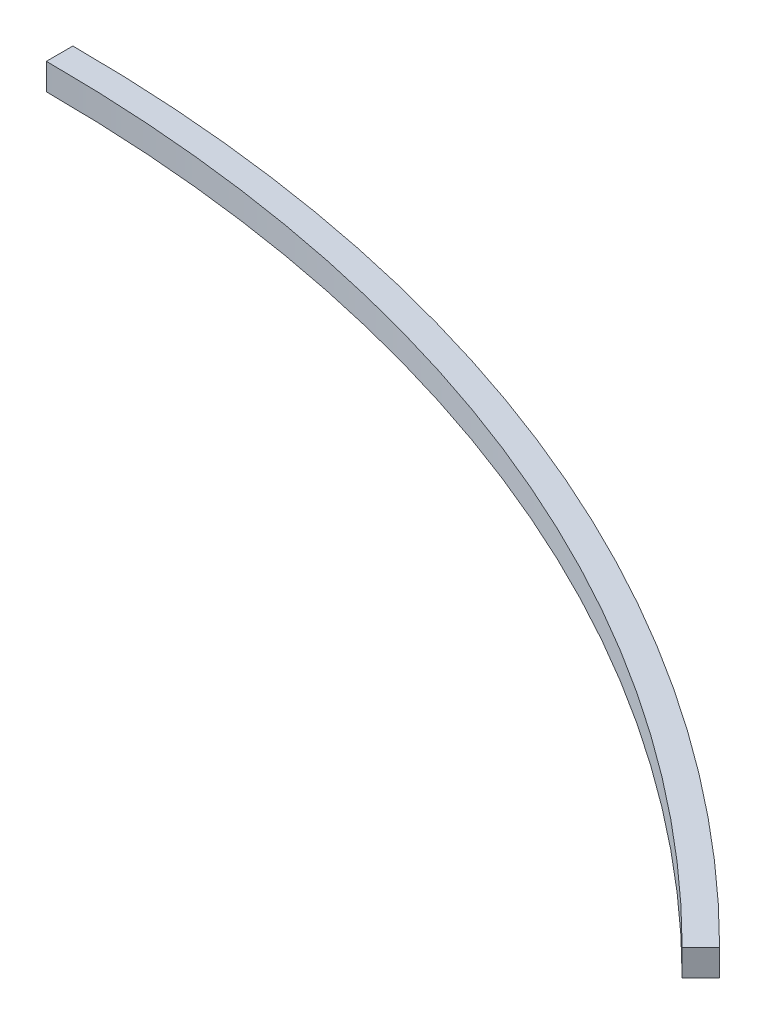
ISO-10303-21;
HEADER;
FILE_DESCRIPTION(('STEP AP214'),'2;1');
FILE_NAME('part.step','',(''),(''),'','','');
FILE_SCHEMA(('AUTOMOTIVE_DESIGN { 1 0 10303 214 1 1 1 1 }'));
ENDSEC;
DATA;
#1=APPLICATION_CONTEXT('core data for automotive mechanical design processes');
#2=APPLICATION_PROTOCOL_DEFINITION('international standard','automotive_design',2000,#1);
#3=PRODUCT_CONTEXT('',#1,'mechanical');
#4=PRODUCT('Part','Part','',(#3));
#5=PRODUCT_RELATED_PRODUCT_CATEGORY('part','',(#4));
#6=PRODUCT_DEFINITION_FORMATION('','',#4);
#7=PRODUCT_DEFINITION_CONTEXT('part definition',#1,'design');
#8=PRODUCT_DEFINITION('design','',#6,#7);
#9=PRODUCT_DEFINITION_SHAPE('','',#8);
#10=(LENGTH_UNIT() NAMED_UNIT(*) SI_UNIT(.MILLI.,.METRE.));
#11=(NAMED_UNIT(*) PLANE_ANGLE_UNIT() SI_UNIT($,.RADIAN.));
#12=(NAMED_UNIT(*) SI_UNIT($,.STERADIAN.) SOLID_ANGLE_UNIT());
#13=UNCERTAINTY_MEASURE_WITH_UNIT(LENGTH_MEASURE(1.E-05),#10,'distance_accuracy_value','');
#14=(GEOMETRIC_REPRESENTATION_CONTEXT(3) GLOBAL_UNCERTAINTY_ASSIGNED_CONTEXT((#13)) GLOBAL_UNIT_ASSIGNED_CONTEXT((#10,
#11,#12)) REPRESENTATION_CONTEXT('',''));
#15=CARTESIAN_POINT('',(0.,0.,0.));
#16=DIRECTION('',(0.,0.,1.));
#17=DIRECTION('',(1.,0.,0.));
#18=AXIS2_PLACEMENT_3D('',#15,#16,#17);
#19=CARTESIAN_POINT('',(0.,10.,0.));
#20=DIRECTION('',(0.,-1.,0.));
#21=DIRECTION('',(0.,0.,-1.));
#22=AXIS2_PLACEMENT_3D('',#19,#20,#21);
#23=CYLINDRICAL_SURFACE('',#22,590.);
#24=CARTESIAN_POINT('',(0.,0.,0.));
#25=DIRECTION('',(0.,1.,0.));
#26=DIRECTION('',(0.,0.,1.));
#27=AXIS2_PLACEMENT_3D('',#24,#25,#26);
#28=CIRCLE('',#27,590.);
#29=CARTESIAN_POINT('',(0.,0.,-590.));
#30=VERTEX_POINT('',#29);
#31=CARTESIAN_POINT('',(417.193000900064,0.,-417.193000900062));
#32=VERTEX_POINT('',#31);
#33=EDGE_CURVE('E97',#30,#32,#28,.F.);
#34=ORIENTED_EDGE('',*,*,#33,.F.);
#35=DIRECTION('',(0.,-1.,0.));
#36=VECTOR('',#35,1.);
#37=CARTESIAN_POINT('',(0.,10.,-590.));
#38=LINE('',#37,#36);
#39=CARTESIAN_POINT('',(0.,10.,-590.));
#40=VERTEX_POINT('',#39);
#41=EDGE_CURVE('E11',#40,#30,#38,.T.);
#42=ORIENTED_EDGE('',*,*,#41,.F.);
#43=CARTESIAN_POINT('',(0.,10.,0.));
#44=DIRECTION('',(0.,1.,0.));
#45=DIRECTION('',(0.,0.,1.));
#46=AXIS2_PLACEMENT_3D('',#43,#44,#45);
#47=CIRCLE('',#46,590.);
#48=CARTESIAN_POINT('',(417.193000900064,10.,-417.193000900062));
#49=VERTEX_POINT('',#48);
#50=EDGE_CURVE('E91',#40,#49,#47,.F.);
#51=ORIENTED_EDGE('',*,*,#50,.T.);
#52=DIRECTION('',(0.,-1.,0.));
#53=VECTOR('',#52,1.);
#54=CARTESIAN_POINT('',(417.193000900064,10.,-417.193000900062));
#55=LINE('',#54,#53);
#56=EDGE_CURVE('E72',#49,#32,#55,.T.);
#57=ORIENTED_EDGE('',*,*,#56,.T.);
#58=EDGE_LOOP('',(#34,#42,#51,#57));
#59=FACE_BOUND('',#58,.T.);
#60=ADVANCED_FACE('F34',(#59),#23,.T.);
#61=CARTESIAN_POINT('',(0.,10.,0.));
#62=DIRECTION('',(-1.,0.,0.));
#63=DIRECTION('',(0.,0.,1.));
#64=AXIS2_PLACEMENT_3D('',#61,#62,#63);
#65=PLANE('',#64);
#66=DIRECTION('',(0.,0.,-1.));
#67=VECTOR('',#66,1.);
#68=CARTESIAN_POINT('',(0.,0.,0.));
#69=LINE('',#68,#67);
#70=CARTESIAN_POINT('',(0.,0.,-580.));
#71=VERTEX_POINT('',#70);
#72=EDGE_CURVE('E85',#71,#30,#69,.T.);
#73=ORIENTED_EDGE('',*,*,#72,.F.);
#74=DIRECTION('',(0.,-1.,0.));
#75=VECTOR('',#74,1.);
#76=CARTESIAN_POINT('',(0.,10.,-580.));
#77=LINE('',#76,#75);
#78=CARTESIAN_POINT('',(0.,10.,-580.));
#79=VERTEX_POINT('',#78);
#80=EDGE_CURVE('E42',#79,#71,#77,.T.);
#81=ORIENTED_EDGE('',*,*,#80,.F.);
#82=DIRECTION('',(0.,0.,-1.));
#83=VECTOR('',#82,1.);
#84=CARTESIAN_POINT('',(0.,10.,0.));
#85=LINE('',#84,#83);
#86=EDGE_CURVE('E83',#79,#40,#85,.T.);
#87=ORIENTED_EDGE('',*,*,#86,.T.);
#88=ORIENTED_EDGE('',*,*,#41,.T.);
#89=EDGE_LOOP('',(#73,#81,#87,#88));
#90=FACE_BOUND('',#89,.T.);
#91=ADVANCED_FACE('F81',(#90),#65,.T.);
#92=CARTESIAN_POINT('',(0.,10.,0.));
#93=DIRECTION('',(0.,-1.,0.));
#94=DIRECTION('',(0.,0.,-1.));
#95=AXIS2_PLACEMENT_3D('',#92,#93,#94);
#96=CYLINDRICAL_SURFACE('',#95,580.);
#97=CARTESIAN_POINT('',(0.,0.,0.));
#98=DIRECTION('',(0.,1.,0.));
#99=DIRECTION('',(0.,0.,1.));
#100=AXIS2_PLACEMENT_3D('',#97,#98,#99);
#101=CIRCLE('',#100,580.);
#102=CARTESIAN_POINT('',(410.121933088198,0.,-410.121933088197));
#103=VERTEX_POINT('',#102);
#104=EDGE_CURVE('E65',#71,#103,#101,.F.);
#105=ORIENTED_EDGE('',*,*,#104,.T.);
#106=DIRECTION('',(0.,-1.,0.));
#107=VECTOR('',#106,1.);
#108=CARTESIAN_POINT('',(410.121933088198,10.,-410.121933088197));
#109=LINE('',#108,#107);
#110=CARTESIAN_POINT('',(410.121933088198,10.,-410.121933088197));
#111=VERTEX_POINT('',#110);
#112=EDGE_CURVE('E86',#111,#103,#109,.T.);
#113=ORIENTED_EDGE('',*,*,#112,.F.);
#114=CARTESIAN_POINT('',(0.,10.,0.));
#115=DIRECTION('',(0.,1.,0.));
#116=DIRECTION('',(0.,0.,1.));
#117=AXIS2_PLACEMENT_3D('',#114,#115,#116);
#118=CIRCLE('',#117,580.);
#119=EDGE_CURVE('E87',#79,#111,#118,.F.);
#120=ORIENTED_EDGE('',*,*,#119,.F.);
#121=ORIENTED_EDGE('',*,*,#80,.T.);
#122=EDGE_LOOP('',(#105,#113,#120,#121));
#123=FACE_BOUND('',#122,.T.);
#124=ADVANCED_FACE('F88',(#123),#96,.F.);
#125=CARTESIAN_POINT('',(2.35513868802567E-12,10.,2.35513868802565E-12));
#126=DIRECTION('',(-0.70710678118655,0.,-0.707106781186545));
#127=DIRECTION('',(-0.707106781186545,0.,0.70710678118655));
#128=AXIS2_PLACEMENT_3D('',#125,#126,#127);
#129=PLANE('',#128);
#130=DIRECTION('',(0.707106781186545,0.,-0.70710678118655));
#131=VECTOR('',#130,1.);
#132=CARTESIAN_POINT('',(2.35513868802567E-12,0.,2.35513868802565E-12));
#133=LINE('',#132,#131);
#134=EDGE_CURVE('E93',#103,#32,#133,.T.);
#135=ORIENTED_EDGE('',*,*,#134,.T.);
#136=ORIENTED_EDGE('',*,*,#56,.F.);
#137=DIRECTION('',(0.707106781186545,0.,-0.70710678118655));
#138=VECTOR('',#137,1.);
#139=CARTESIAN_POINT('',(2.35513868802567E-12,10.,2.35513868802565E-12));
#140=LINE('',#139,#138);
#141=EDGE_CURVE('E50',#111,#49,#140,.T.);
#142=ORIENTED_EDGE('',*,*,#141,.F.);
#143=ORIENTED_EDGE('',*,*,#112,.T.);
#144=EDGE_LOOP('',(#135,#136,#142,#143));
#145=FACE_BOUND('',#144,.T.);
#146=ADVANCED_FACE('F106',(#145),#129,.F.);
#147=CARTESIAN_POINT('',(0.,10.,0.));
#148=DIRECTION('',(0.,1.,0.));
#149=DIRECTION('',(0.,0.,1.));
#150=AXIS2_PLACEMENT_3D('',#147,#148,#149);
#151=PLANE('',#150);
#152=ORIENTED_EDGE('',*,*,#50,.F.);
#153=ORIENTED_EDGE('',*,*,#86,.F.);
#154=ORIENTED_EDGE('',*,*,#119,.T.);
#155=ORIENTED_EDGE('',*,*,#141,.T.);
#156=EDGE_LOOP('',(#152,#153,#154,#155));
#157=FACE_BOUND('',#156,.T.);
#158=ADVANCED_FACE('F90',(#157),#151,.T.);
#159=CARTESIAN_POINT('',(0.,0.,0.));
#160=DIRECTION('',(0.,1.,0.));
#161=DIRECTION('',(0.,0.,1.));
#162=AXIS2_PLACEMENT_3D('',#159,#160,#161);
#163=PLANE('',#162);
#164=ORIENTED_EDGE('',*,*,#33,.T.);
#165=ORIENTED_EDGE('',*,*,#134,.F.);
#166=ORIENTED_EDGE('',*,*,#104,.F.);
#167=ORIENTED_EDGE('',*,*,#72,.T.);
#168=EDGE_LOOP('',(#164,#165,#166,#167));
#169=FACE_BOUND('',#168,.T.);
#170=ADVANCED_FACE('F108',(#169),#163,.F.);
#171=CLOSED_SHELL('',(#60,#91,#124,#146,#158,#170));
#172=MANIFOLD_SOLID_BREP('B2',#171);
#173=ADVANCED_BREP_SHAPE_REPRESENTATION('',(#18,#172),#14);
#174=SHAPE_DEFINITION_REPRESENTATION(#9,#173);
ENDSEC;
END-ISO-10303-21;
